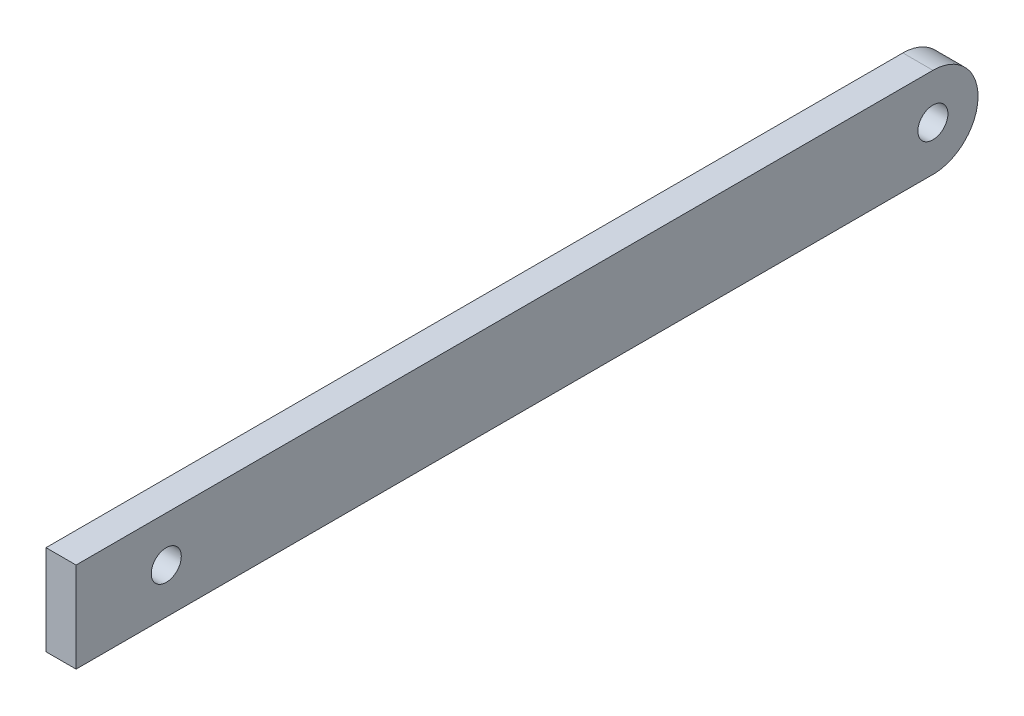
ISO-10303-21;
HEADER;
FILE_DESCRIPTION(('STEP AP214'),'2;1');
FILE_NAME('part.step','',(''),(''),'','','');
FILE_SCHEMA(('AUTOMOTIVE_DESIGN { 1 0 10303 214 1 1 1 1 }'));
ENDSEC;
DATA;
#1=APPLICATION_CONTEXT('core data for automotive mechanical design processes');
#2=APPLICATION_PROTOCOL_DEFINITION('international standard','automotive_design',2000,#1);
#3=PRODUCT_CONTEXT('',#1,'mechanical');
#4=PRODUCT('Part','Part','',(#3));
#5=PRODUCT_RELATED_PRODUCT_CATEGORY('part','',(#4));
#6=PRODUCT_DEFINITION_FORMATION('','',#4);
#7=PRODUCT_DEFINITION_CONTEXT('part definition',#1,'design');
#8=PRODUCT_DEFINITION('design','',#6,#7);
#9=PRODUCT_DEFINITION_SHAPE('','',#8);
#10=(LENGTH_UNIT() NAMED_UNIT(*) SI_UNIT(.MILLI.,.METRE.));
#11=(NAMED_UNIT(*) PLANE_ANGLE_UNIT() SI_UNIT($,.RADIAN.));
#12=(NAMED_UNIT(*) SI_UNIT($,.STERADIAN.) SOLID_ANGLE_UNIT());
#13=UNCERTAINTY_MEASURE_WITH_UNIT(LENGTH_MEASURE(1.E-05),#10,'distance_accuracy_value','');
#14=(GEOMETRIC_REPRESENTATION_CONTEXT(3) GLOBAL_UNCERTAINTY_ASSIGNED_CONTEXT((#13)) GLOBAL_UNIT_ASSIGNED_CONTEXT((#10,
#11,#12)) REPRESENTATION_CONTEXT('',''));
#15=CARTESIAN_POINT('',(0.,0.,0.));
#16=DIRECTION('',(0.,0.,1.));
#17=DIRECTION('',(1.,0.,0.));
#18=AXIS2_PLACEMENT_3D('',#15,#16,#17);
#19=CARTESIAN_POINT('',(-4.22535211267605,30.,-14.1901408450704));
#20=DIRECTION('',(1.,0.,0.));
#21=DIRECTION('',(0.,0.,-1.));
#22=AXIS2_PLACEMENT_3D('',#19,#20,#21);
#23=PLANE('',#22);
#24=CARTESIAN_POINT('',(-4.22535211267602,15.,255.80985915493));
#25=DIRECTION('',(1.,0.,0.));
#26=DIRECTION('',(0.,0.,-1.));
#27=AXIS2_PLACEMENT_3D('',#24,#25,#26);
#28=CIRCLE('',#27,4.99999999999999);
#29=CARTESIAN_POINT('',(-4.22535211267602,15.,250.80985915493));
#30=VERTEX_POINT('',#29);
#31=EDGE_CURVE('E140',#30,#30,#28,.T.);
#32=ORIENTED_EDGE('',*,*,#31,.T.);
#33=EDGE_LOOP('',(#32));
#34=FACE_BOUND('',#33,.T.);
#35=CARTESIAN_POINT('',(-4.22535211267605,14.988765407663,0.821097954468696));
#36=DIRECTION('',(1.,0.,0.));
#37=DIRECTION('',(0.,0.,-1.));
#38=AXIS2_PLACEMENT_3D('',#35,#36,#37);
#39=CIRCLE('',#38,5.);
#40=CARTESIAN_POINT('',(-4.22535211267605,14.988765407663,-4.1789020455313));
#41=VERTEX_POINT('',#40);
#42=EDGE_CURVE('E134',#41,#41,#39,.T.);
#43=ORIENTED_EDGE('',*,*,#42,.T.);
#44=EDGE_LOOP('',(#43));
#45=FACE_BOUND('',#44,.T.);
#46=CARTESIAN_POINT('',(-4.22535211267605,14.988765407663,0.821097954468696));
#47=DIRECTION('',(1.,0.,0.));
#48=DIRECTION('',(0.,0.,-1.));
#49=AXIS2_PLACEMENT_3D('',#46,#47,#48);
#50=CIRCLE('',#49,15.0112387995391);
#51=CARTESIAN_POINT('',(-4.22535211267605,30.,0.80985915492956));
#52=VERTEX_POINT('',#51);
#53=CARTESIAN_POINT('',(-4.22535211267605,0.,0.));
#54=VERTEX_POINT('',#53);
#55=EDGE_CURVE('E73',#52,#54,#50,.F.);
#56=ORIENTED_EDGE('',*,*,#55,.T.);
#57=DIRECTION('',(0.,0.,1.));
#58=VECTOR('',#57,1.);
#59=CARTESIAN_POINT('',(-4.22535211267605,0.,-14.1901408450704));
#60=LINE('',#59,#58);
#61=CARTESIAN_POINT('',(-4.22535211267602,0.,285.80985915493));
#62=VERTEX_POINT('',#61);
#63=EDGE_CURVE('E106',#54,#62,#60,.T.);
#64=ORIENTED_EDGE('',*,*,#63,.T.);
#65=DIRECTION('',(0.,-1.,0.));
#66=VECTOR('',#65,1.);
#67=CARTESIAN_POINT('',(-4.22535211267602,30.,285.80985915493));
#68=LINE('',#67,#66);
#69=CARTESIAN_POINT('',(-4.22535211267602,30.,285.80985915493));
#70=VERTEX_POINT('',#69);
#71=EDGE_CURVE('E101',#70,#62,#68,.T.);
#72=ORIENTED_EDGE('',*,*,#71,.F.);
#73=DIRECTION('',(0.,0.,1.));
#74=VECTOR('',#73,1.);
#75=CARTESIAN_POINT('',(-4.22535211267605,30.,-14.1901408450704));
#76=LINE('',#75,#74);
#77=EDGE_CURVE('E116',#52,#70,#76,.T.);
#78=ORIENTED_EDGE('',*,*,#77,.F.);
#79=EDGE_LOOP('',(#56,#64,#72,#78));
#80=FACE_BOUND('',#79,.T.);
#81=ADVANCED_FACE('F59',(#34,#45,#80),#23,.F.);
#82=CARTESIAN_POINT('',(5.77464788732394,30.,-14.1901408450704));
#83=DIRECTION('',(-1.,0.,0.));
#84=DIRECTION('',(0.,0.,1.));
#85=AXIS2_PLACEMENT_3D('',#82,#83,#84);
#86=PLANE('',#85);
#87=CARTESIAN_POINT('',(5.77464788732398,15.,255.80985915493));
#88=DIRECTION('',(1.,0.,0.));
#89=DIRECTION('',(0.,0.,-1.));
#90=AXIS2_PLACEMENT_3D('',#87,#88,#89);
#91=CIRCLE('',#90,4.99999999999999);
#92=CARTESIAN_POINT('',(5.77464788732398,15.,250.80985915493));
#93=VERTEX_POINT('',#92);
#94=EDGE_CURVE('E143',#93,#93,#91,.T.);
#95=ORIENTED_EDGE('',*,*,#94,.F.);
#96=EDGE_LOOP('',(#95));
#97=FACE_BOUND('',#96,.T.);
#98=CARTESIAN_POINT('',(5.77464788732395,14.988765407663,0.821097954468695));
#99=DIRECTION('',(1.,0.,0.));
#100=DIRECTION('',(0.,0.,-1.));
#101=AXIS2_PLACEMENT_3D('',#98,#99,#100);
#102=CIRCLE('',#101,5.);
#103=CARTESIAN_POINT('',(5.77464788732395,14.988765407663,-4.17890204553131));
#104=VERTEX_POINT('',#103);
#105=EDGE_CURVE('E136',#104,#104,#102,.T.);
#106=ORIENTED_EDGE('',*,*,#105,.F.);
#107=EDGE_LOOP('',(#106));
#108=FACE_BOUND('',#107,.T.);
#109=DIRECTION('',(0.,0.,-1.));
#110=VECTOR('',#109,1.);
#111=CARTESIAN_POINT('',(5.77464788732394,0.,-14.1901408450704));
#112=LINE('',#111,#110);
#113=CARTESIAN_POINT('',(5.77464788732398,0.,285.80985915493));
#114=VERTEX_POINT('',#113);
#115=CARTESIAN_POINT('',(5.77464788732395,0.,0.));
#116=VERTEX_POINT('',#115);
#117=EDGE_CURVE('E105',#114,#116,#112,.T.);
#118=ORIENTED_EDGE('',*,*,#117,.T.);
#119=CARTESIAN_POINT('',(5.77464788732395,14.988765407663,0.821097954468695));
#120=DIRECTION('',(1.,0.,0.));
#121=DIRECTION('',(0.,0.,-1.));
#122=AXIS2_PLACEMENT_3D('',#119,#120,#121);
#123=CIRCLE('',#122,15.0112387995391);
#124=CARTESIAN_POINT('',(5.77464788732395,30.,0.809859154929559));
#125=VERTEX_POINT('',#124);
#126=EDGE_CURVE('E124',#125,#116,#123,.F.);
#127=ORIENTED_EDGE('',*,*,#126,.F.);
#128=DIRECTION('',(0.,0.,-1.));
#129=VECTOR('',#128,1.);
#130=CARTESIAN_POINT('',(5.77464788732394,30.,-14.1901408450704));
#131=LINE('',#130,#129);
#132=CARTESIAN_POINT('',(5.77464788732398,30.,285.80985915493));
#133=VERTEX_POINT('',#132);
#134=EDGE_CURVE('E113',#133,#125,#131,.T.);
#135=ORIENTED_EDGE('',*,*,#134,.F.);
#136=DIRECTION('',(0.,-1.,0.));
#137=VECTOR('',#136,1.);
#138=CARTESIAN_POINT('',(5.77464788732398,30.,285.80985915493));
#139=LINE('',#138,#137);
#140=EDGE_CURVE('E98',#133,#114,#139,.T.);
#141=ORIENTED_EDGE('',*,*,#140,.T.);
#142=EDGE_LOOP('',(#118,#127,#135,#141));
#143=FACE_BOUND('',#142,.T.);
#144=ADVANCED_FACE('F110',(#97,#108,#143),#86,.F.);
#145=CARTESIAN_POINT('',(-4.22535211267602,30.,285.80985915493));
#146=DIRECTION('',(0.,0.,-1.));
#147=DIRECTION('',(-1.,0.,0.));
#148=AXIS2_PLACEMENT_3D('',#145,#146,#147);
#149=PLANE('',#148);
#150=DIRECTION('',(1.,0.,0.));
#151=VECTOR('',#150,1.);
#152=CARTESIAN_POINT('',(-4.22535211267602,0.,285.80985915493));
#153=LINE('',#152,#151);
#154=EDGE_CURVE('E95',#62,#114,#153,.T.);
#155=ORIENTED_EDGE('',*,*,#154,.T.);
#156=ORIENTED_EDGE('',*,*,#140,.F.);
#157=DIRECTION('',(1.,0.,0.));
#158=VECTOR('',#157,1.);
#159=CARTESIAN_POINT('',(-4.22535211267602,30.,285.80985915493));
#160=LINE('',#159,#158);
#161=EDGE_CURVE('E82',#70,#133,#160,.T.);
#162=ORIENTED_EDGE('',*,*,#161,.F.);
#163=ORIENTED_EDGE('',*,*,#71,.T.);
#164=EDGE_LOOP('',(#155,#156,#162,#163));
#165=FACE_BOUND('',#164,.T.);
#166=ADVANCED_FACE('F97',(#165),#149,.F.);
#167=CARTESIAN_POINT('',(0.,30.,0.));
#168=DIRECTION('',(0.,1.,0.));
#169=DIRECTION('',(0.,0.,1.));
#170=AXIS2_PLACEMENT_3D('',#167,#168,#169);
#171=PLANE('',#170);
#172=DIRECTION('',(1.,0.,0.));
#173=VECTOR('',#172,1.);
#174=CARTESIAN_POINT('',(-24.2253521126761,30.,0.809859154929563));
#175=LINE('',#174,#173);
#176=EDGE_CURVE('E66',#52,#125,#175,.T.);
#177=ORIENTED_EDGE('',*,*,#176,.F.);
#178=ORIENTED_EDGE('',*,*,#77,.T.);
#179=ORIENTED_EDGE('',*,*,#161,.T.);
#180=ORIENTED_EDGE('',*,*,#134,.T.);
#181=EDGE_LOOP('',(#177,#178,#179,#180));
#182=FACE_BOUND('',#181,.T.);
#183=ADVANCED_FACE('F203',(#182),#171,.T.);
#184=CARTESIAN_POINT('',(0.,0.,0.));
#185=DIRECTION('',(0.,1.,0.));
#186=DIRECTION('',(0.,0.,1.));
#187=AXIS2_PLACEMENT_3D('',#184,#185,#186);
#188=PLANE('',#187);
#189=ORIENTED_EDGE('',*,*,#63,.F.);
#190=DIRECTION('',(1.,0.,0.));
#191=VECTOR('',#190,1.);
#192=CARTESIAN_POINT('',(-24.2253521126761,0.,0.));
#193=LINE('',#192,#191);
#194=EDGE_CURVE('E12',#54,#116,#193,.T.);
#195=ORIENTED_EDGE('',*,*,#194,.T.);
#196=ORIENTED_EDGE('',*,*,#117,.F.);
#197=ORIENTED_EDGE('',*,*,#154,.F.);
#198=EDGE_LOOP('',(#189,#195,#196,#197));
#199=FACE_BOUND('',#198,.T.);
#200=ADVANCED_FACE('F115',(#199),#188,.F.);
#201=CARTESIAN_POINT('',(-24.2253521126761,14.988765407663,0.821097954468698));
#202=DIRECTION('',(1.,0.,0.));
#203=DIRECTION('',(0.,0.,-1.));
#204=AXIS2_PLACEMENT_3D('',#201,#202,#203);
#205=CYLINDRICAL_SURFACE('',#204,15.0112387995391);
#206=ORIENTED_EDGE('',*,*,#176,.T.);
#207=ORIENTED_EDGE('',*,*,#126,.T.);
#208=ORIENTED_EDGE('',*,*,#194,.F.);
#209=ORIENTED_EDGE('',*,*,#55,.F.);
#210=EDGE_LOOP('',(#206,#207,#208,#209));
#211=FACE_BOUND('',#210,.T.);
#212=ADVANCED_FACE('F133',(#211),#205,.T.);
#213=CARTESIAN_POINT('',(-24.2253521126761,14.988765407663,0.821097954468698));
#214=DIRECTION('',(1.,0.,0.));
#215=DIRECTION('',(0.,0.,-1.));
#216=AXIS2_PLACEMENT_3D('',#213,#214,#215);
#217=CYLINDRICAL_SURFACE('',#216,5.);
#218=ORIENTED_EDGE('',*,*,#105,.T.);
#219=EDGE_LOOP('',(#218));
#220=FACE_BOUND('',#219,.T.);
#221=ORIENTED_EDGE('',*,*,#42,.F.);
#222=EDGE_LOOP('',(#221));
#223=FACE_BOUND('',#222,.T.);
#224=ADVANCED_FACE('F153',(#220,#223),#217,.F.);
#225=CARTESIAN_POINT('',(-4.22535211267602,15.,255.80985915493));
#226=DIRECTION('',(1.,0.,0.));
#227=DIRECTION('',(0.,0.,-1.));
#228=AXIS2_PLACEMENT_3D('',#225,#226,#227);
#229=CYLINDRICAL_SURFACE('',#228,4.99999999999999);
#230=ORIENTED_EDGE('',*,*,#31,.F.);
#231=EDGE_LOOP('',(#230));
#232=FACE_BOUND('',#231,.T.);
#233=ORIENTED_EDGE('',*,*,#94,.T.);
#234=EDGE_LOOP('',(#233));
#235=FACE_BOUND('',#234,.T.);
#236=ADVANCED_FACE('F150',(#232,#235),#229,.F.);
#237=CLOSED_SHELL('',(#81,#144,#166,#183,#200,#212,#224,#236));
#238=MANIFOLD_SOLID_BREP('B2',#237);
#239=ADVANCED_BREP_SHAPE_REPRESENTATION('',(#18,#238),#14);
#240=SHAPE_DEFINITION_REPRESENTATION(#9,#239);
ENDSEC;
END-ISO-10303-21;
